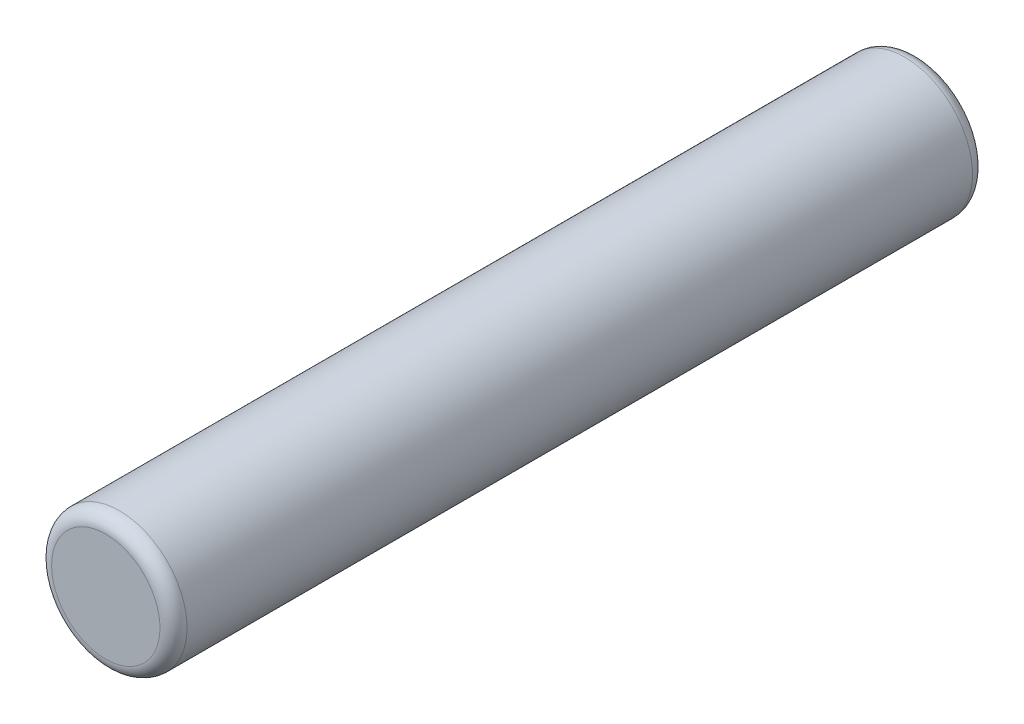
ISO-10303-21;
HEADER;
FILE_DESCRIPTION(('STEP AP214'),'2;1');
FILE_NAME('part.step','',(''),(''),'','','');
FILE_SCHEMA(('AUTOMOTIVE_DESIGN { 1 0 10303 214 1 1 1 1 }'));
ENDSEC;
DATA;
#1=APPLICATION_CONTEXT('core data for automotive mechanical design processes');
#2=APPLICATION_PROTOCOL_DEFINITION('international standard','automotive_design',2000,#1);
#3=PRODUCT_CONTEXT('',#1,'mechanical');
#4=PRODUCT('Part','Part','',(#3));
#5=PRODUCT_RELATED_PRODUCT_CATEGORY('part','',(#4));
#6=PRODUCT_DEFINITION_FORMATION('','',#4);
#7=PRODUCT_DEFINITION_CONTEXT('part definition',#1,'design');
#8=PRODUCT_DEFINITION('design','',#6,#7);
#9=PRODUCT_DEFINITION_SHAPE('','',#8);
#10=(LENGTH_UNIT() NAMED_UNIT(*) SI_UNIT(.MILLI.,.METRE.));
#11=(NAMED_UNIT(*) PLANE_ANGLE_UNIT() SI_UNIT($,.RADIAN.));
#12=(NAMED_UNIT(*) SI_UNIT($,.STERADIAN.) SOLID_ANGLE_UNIT());
#13=UNCERTAINTY_MEASURE_WITH_UNIT(LENGTH_MEASURE(1.E-05),#10,'distance_accuracy_value','');
#14=(GEOMETRIC_REPRESENTATION_CONTEXT(3) GLOBAL_UNCERTAINTY_ASSIGNED_CONTEXT((#13)) GLOBAL_UNIT_ASSIGNED_CONTEXT((#10,
#11,#12)) REPRESENTATION_CONTEXT('',''));
#15=CARTESIAN_POINT('',(0.,0.,0.));
#16=DIRECTION('',(0.,0.,1.));
#17=DIRECTION('',(1.,0.,0.));
#18=AXIS2_PLACEMENT_3D('',#15,#16,#17);
#19=CARTESIAN_POINT('',(-1.17557050458466,-1.61803398874999,3.));
#20=DIRECTION('',(0.,0.,1.));
#21=DIRECTION('',(1.,0.,0.));
#22=AXIS2_PLACEMENT_3D('',#19,#20,#21);
#23=PLANE('',#22);
#24=CARTESIAN_POINT('',(-1.17557050458466,-1.61803398874999,3.));
#25=DIRECTION('',(0.,0.,-1.));
#26=DIRECTION('',(-1.,0.,0.));
#27=AXIS2_PLACEMENT_3D('',#24,#25,#26);
#28=CIRCLE('',#27,0.4);
#29=CARTESIAN_POINT('',(-1.57557050458466,-1.61803398874999,3.));
#30=VERTEX_POINT('',#29);
#31=EDGE_CURVE('E62',#30,#30,#28,.T.);
#32=ORIENTED_EDGE('',*,*,#31,.F.);
#33=EDGE_LOOP('',(#32));
#34=FACE_BOUND('',#33,.T.);
#35=ADVANCED_FACE('F15',(#34),#23,.T.);
#36=CARTESIAN_POINT('',(-1.17557050458466,-1.61803398874999,-3.));
#37=DIRECTION('',(0.,0.,1.));
#38=DIRECTION('',(1.,0.,0.));
#39=AXIS2_PLACEMENT_3D('',#36,#37,#38);
#40=PLANE('',#39);
#41=CARTESIAN_POINT('',(-1.17557050458466,-1.61803398874999,-3.));
#42=DIRECTION('',(0.,0.,1.));
#43=DIRECTION('',(-1.,0.,0.));
#44=AXIS2_PLACEMENT_3D('',#41,#42,#43);
#45=CIRCLE('',#44,0.4);
#46=CARTESIAN_POINT('',(-1.57557050458466,-1.61803398874999,-3.));
#47=VERTEX_POINT('',#46);
#48=EDGE_CURVE('E30',#47,#47,#45,.T.);
#49=ORIENTED_EDGE('',*,*,#48,.F.);
#50=EDGE_LOOP('',(#49));
#51=FACE_BOUND('',#50,.T.);
#52=ADVANCED_FACE('F75',(#51),#40,.F.);
#53=CARTESIAN_POINT('',(-1.17557050458466,-1.61803398874999,2.9));
#54=DIRECTION('',(0.,0.,-1.));
#55=DIRECTION('',(1.,0.,0.));
#56=AXIS2_PLACEMENT_3D('',#53,#54,#55);
#57=TOROIDAL_SURFACE('',#56,0.4,0.1);
#58=ORIENTED_EDGE('',*,*,#31,.T.);
#59=EDGE_LOOP('',(#58));
#60=FACE_BOUND('',#59,.T.);
#61=CARTESIAN_POINT('',(-1.17557050458466,-1.61803398874999,2.9));
#62=DIRECTION('',(0.,0.,-1.));
#63=DIRECTION('',(-1.,0.,0.));
#64=AXIS2_PLACEMENT_3D('',#61,#62,#63);
#65=CIRCLE('',#64,0.5);
#66=CARTESIAN_POINT('',(-1.67557050458466,-1.61803398874999,2.9));
#67=VERTEX_POINT('',#66);
#68=EDGE_CURVE('E25',#67,#67,#65,.T.);
#69=ORIENTED_EDGE('',*,*,#68,.F.);
#70=EDGE_LOOP('',(#69));
#71=FACE_BOUND('',#70,.T.);
#72=ADVANCED_FACE('F43',(#60,#71),#57,.T.);
#73=CARTESIAN_POINT('',(-1.17557050458466,-1.61803398874999,-2.9));
#74=DIRECTION('',(0.,0.,-1.));
#75=DIRECTION('',(1.,0.,0.));
#76=AXIS2_PLACEMENT_3D('',#73,#74,#75);
#77=TOROIDAL_SURFACE('',#76,0.4,0.1);
#78=CARTESIAN_POINT('',(-1.17557050458466,-1.61803398874999,-2.9));
#79=DIRECTION('',(0.,0.,-1.));
#80=DIRECTION('',(-1.,0.,0.));
#81=AXIS2_PLACEMENT_3D('',#78,#79,#80);
#82=CIRCLE('',#81,0.5);
#83=CARTESIAN_POINT('',(-1.67557050458466,-1.61803398874999,-2.9));
#84=VERTEX_POINT('',#83);
#85=EDGE_CURVE('E10',#84,#84,#82,.F.);
#86=ORIENTED_EDGE('',*,*,#85,.F.);
#87=EDGE_LOOP('',(#86));
#88=FACE_BOUND('',#87,.T.);
#89=ORIENTED_EDGE('',*,*,#48,.T.);
#90=EDGE_LOOP('',(#89));
#91=FACE_BOUND('',#90,.T.);
#92=ADVANCED_FACE('F38',(#88,#91),#77,.T.);
#93=CARTESIAN_POINT('',(-1.17557050458466,-1.61803398874999,-3.));
#94=DIRECTION('',(0.,0.,-1.));
#95=DIRECTION('',(-1.,0.,0.));
#96=AXIS2_PLACEMENT_3D('',#93,#94,#95);
#97=CYLINDRICAL_SURFACE('',#96,0.5);
#98=ORIENTED_EDGE('',*,*,#85,.T.);
#99=EDGE_LOOP('',(#98));
#100=FACE_BOUND('',#99,.T.);
#101=ORIENTED_EDGE('',*,*,#68,.T.);
#102=EDGE_LOOP('',(#101));
#103=FACE_BOUND('',#102,.T.);
#104=ADVANCED_FACE('F42',(#100,#103),#97,.T.);
#105=CLOSED_SHELL('',(#35,#52,#72,#92,#104));
#106=MANIFOLD_SOLID_BREP('B1',#105);
#107=ADVANCED_BREP_SHAPE_REPRESENTATION('',(#18,#106),#14);
#108=SHAPE_DEFINITION_REPRESENTATION(#9,#107);
ENDSEC;
END-ISO-10303-21;
